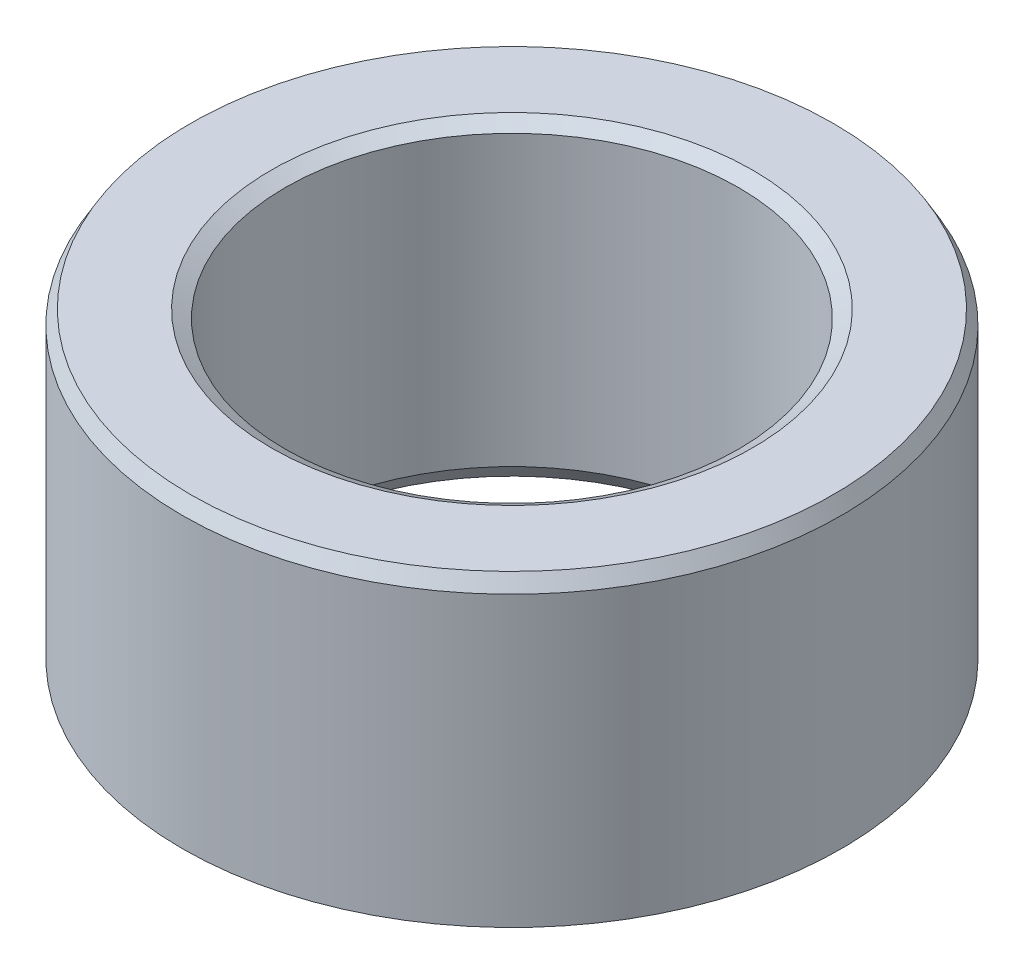
ISO-10303-21;
HEADER;
FILE_DESCRIPTION(('STEP AP214'),'2;1');
FILE_NAME('part.step','',(''),(''),'','','');
FILE_SCHEMA(('AUTOMOTIVE_DESIGN { 1 0 10303 214 1 1 1 1 }'));
ENDSEC;
DATA;
#1=APPLICATION_CONTEXT('core data for automotive mechanical design processes');
#2=APPLICATION_PROTOCOL_DEFINITION('international standard','automotive_design',2000,#1);
#3=PRODUCT_CONTEXT('',#1,'mechanical');
#4=PRODUCT('Part','Part','',(#3));
#5=PRODUCT_RELATED_PRODUCT_CATEGORY('part','',(#4));
#6=PRODUCT_DEFINITION_FORMATION('','',#4);
#7=PRODUCT_DEFINITION_CONTEXT('part definition',#1,'design');
#8=PRODUCT_DEFINITION('design','',#6,#7);
#9=PRODUCT_DEFINITION_SHAPE('','',#8);
#10=(LENGTH_UNIT() NAMED_UNIT(*) SI_UNIT(.MILLI.,.METRE.));
#11=(NAMED_UNIT(*) PLANE_ANGLE_UNIT() SI_UNIT($,.RADIAN.));
#12=(NAMED_UNIT(*) SI_UNIT($,.STERADIAN.) SOLID_ANGLE_UNIT());
#13=UNCERTAINTY_MEASURE_WITH_UNIT(LENGTH_MEASURE(1.E-05),#10,'distance_accuracy_value','');
#14=(GEOMETRIC_REPRESENTATION_CONTEXT(3) GLOBAL_UNCERTAINTY_ASSIGNED_CONTEXT((#13)) GLOBAL_UNIT_ASSIGNED_CONTEXT((#10,
#11,#12)) REPRESENTATION_CONTEXT('',''));
#15=CARTESIAN_POINT('',(0.,0.,0.));
#16=DIRECTION('',(0.,0.,1.));
#17=DIRECTION('',(1.,0.,0.));
#18=AXIS2_PLACEMENT_3D('',#15,#16,#17);
#19=CARTESIAN_POINT('',(0.,33.0032769411788,0.));
#20=DIRECTION('',(0.,-1.,0.));
#21=DIRECTION('',(0.,0.,-1.));
#22=AXIS2_PLACEMENT_3D('',#19,#20,#21);
#23=CYLINDRICAL_SURFACE('',#22,35.);
#24=CARTESIAN_POINT('',(0.,0.861359611604738,0.));
#25=DIRECTION('',(0.,1.,0.));
#26=DIRECTION('',(0.,0.,1.));
#27=AXIS2_PLACEMENT_3D('',#24,#25,#26);
#28=CIRCLE('',#27,35.);
#29=CARTESIAN_POINT('',(0.,0.861359611604738,35.));
#30=VERTEX_POINT('',#29);
#31=EDGE_CURVE('E10',#30,#30,#28,.T.);
#32=ORIENTED_EDGE('',*,*,#31,.T.);
#33=EDGE_LOOP('',(#32));
#34=FACE_BOUND('',#33,.T.);
#35=CARTESIAN_POINT('',(0.,31.5113583302916,0.));
#36=DIRECTION('',(0.,1.,0.));
#37=DIRECTION('',(0.,0.,1.));
#38=AXIS2_PLACEMENT_3D('',#35,#36,#37);
#39=CIRCLE('',#38,35.);
#40=CARTESIAN_POINT('',(0.,31.5113583302916,35.));
#41=VERTEX_POINT('',#40);
#42=EDGE_CURVE('E50',#41,#41,#39,.F.);
#43=ORIENTED_EDGE('',*,*,#42,.T.);
#44=EDGE_LOOP('',(#43));
#45=FACE_BOUND('',#44,.T.);
#46=ADVANCED_FACE('F39',(#34,#45),#23,.T.);
#47=CARTESIAN_POINT('',(0.,33.0032769411788,0.));
#48=DIRECTION('',(0.,1.,0.));
#49=DIRECTION('',(0.,0.,1.));
#50=AXIS2_PLACEMENT_3D('',#47,#48,#49);
#51=PLANE('',#50);
#52=CARTESIAN_POINT('',(0.,33.0032769411788,0.));
#53=DIRECTION('',(0.,1.,0.));
#54=DIRECTION('',(0.,0.,1.));
#55=AXIS2_PLACEMENT_3D('',#52,#53,#54);
#56=CIRCLE('',#55,25.5603999597916);
#57=CARTESIAN_POINT('',(0.,33.0032769411788,25.5603999597916));
#58=VERTEX_POINT('',#57);
#59=EDGE_CURVE('E58',#58,#58,#56,.F.);
#60=ORIENTED_EDGE('',*,*,#59,.T.);
#61=EDGE_LOOP('',(#60));
#62=FACE_BOUND('',#61,.T.);
#63=CARTESIAN_POINT('',(0.,33.0032769411788,0.));
#64=DIRECTION('',(0.,1.,0.));
#65=DIRECTION('',(0.,0.,1.));
#66=AXIS2_PLACEMENT_3D('',#63,#64,#65);
#67=CIRCLE('',#66,34.1386403883952);
#68=CARTESIAN_POINT('',(0.,33.0032769411788,34.1386403883952));
#69=VERTEX_POINT('',#68);
#70=EDGE_CURVE('E61',#69,#69,#67,.T.);
#71=ORIENTED_EDGE('',*,*,#70,.T.);
#72=EDGE_LOOP('',(#71));
#73=FACE_BOUND('',#72,.T.);
#74=ADVANCED_FACE('F88',(#62,#73),#51,.T.);
#75=CARTESIAN_POINT('',(0.,0.,0.));
#76=DIRECTION('',(0.,1.,0.));
#77=DIRECTION('',(0.,0.,1.));
#78=AXIS2_PLACEMENT_3D('',#75,#76,#77);
#79=PLANE('',#78);
#80=CARTESIAN_POINT('',(0.,0.,0.));
#81=DIRECTION('',(0.,1.,0.));
#82=DIRECTION('',(0.,0.,1.));
#83=AXIS2_PLACEMENT_3D('',#80,#81,#82);
#84=CIRCLE('',#83,24.9298409605091);
#85=CARTESIAN_POINT('',(0.,0.,24.9298409605091));
#86=VERTEX_POINT('',#85);
#87=EDGE_CURVE('E51',#86,#86,#84,.T.);
#88=ORIENTED_EDGE('',*,*,#87,.T.);
#89=EDGE_LOOP('',(#88));
#90=FACE_BOUND('',#89,.T.);
#91=CARTESIAN_POINT('',(0.,0.,0.));
#92=DIRECTION('',(0.,1.,0.));
#93=DIRECTION('',(0.,0.,1.));
#94=AXIS2_PLACEMENT_3D('',#91,#92,#93);
#95=CIRCLE('',#94,33.5080813891128);
#96=CARTESIAN_POINT('',(0.,0.,33.5080813891128));
#97=VERTEX_POINT('',#96);
#98=EDGE_CURVE('E54',#97,#97,#95,.F.);
#99=ORIENTED_EDGE('',*,*,#98,.T.);
#100=EDGE_LOOP('',(#99));
#101=FACE_BOUND('',#100,.T.);
#102=ADVANCED_FACE('F83',(#90,#101),#79,.F.);
#103=CARTESIAN_POINT('',(0.,33.0032769411788,0.));
#104=DIRECTION('',(0.,-1.,0.));
#105=DIRECTION('',(0.,0.,-1.));
#106=AXIS2_PLACEMENT_3D('',#103,#104,#105);
#107=CYLINDRICAL_SURFACE('',#106,24.0684813489044);
#108=CARTESIAN_POINT('',(0.,32.1419173295741,0.));
#109=DIRECTION('',(0.,1.,0.));
#110=DIRECTION('',(0.,0.,1.));
#111=AXIS2_PLACEMENT_3D('',#108,#109,#110);
#112=CIRCLE('',#111,24.0684813489044);
#113=CARTESIAN_POINT('',(0.,32.1419173295741,24.0684813489044));
#114=VERTEX_POINT('',#113);
#115=EDGE_CURVE('E67',#114,#114,#112,.T.);
#116=ORIENTED_EDGE('',*,*,#115,.T.);
#117=EDGE_LOOP('',(#116));
#118=FACE_BOUND('',#117,.T.);
#119=CARTESIAN_POINT('',(0.,1.49191861088722,0.));
#120=DIRECTION('',(0.,1.,0.));
#121=DIRECTION('',(0.,0.,1.));
#122=AXIS2_PLACEMENT_3D('',#119,#120,#121);
#123=CIRCLE('',#122,24.0684813489044);
#124=CARTESIAN_POINT('',(0.,1.49191861088722,24.0684813489044));
#125=VERTEX_POINT('',#124);
#126=EDGE_CURVE('E69',#125,#125,#123,.F.);
#127=ORIENTED_EDGE('',*,*,#126,.T.);
#128=EDGE_LOOP('',(#127));
#129=FACE_BOUND('',#128,.T.);
#130=ADVANCED_FACE('F71',(#118,#129),#107,.F.);
#131=CARTESIAN_POINT('',(0.,32.1419173295741,0.));
#132=DIRECTION('',(0.,1.,0.));
#133=DIRECTION('',(0.,0.,1.));
#134=AXIS2_PLACEMENT_3D('',#131,#132,#133);
#135=CONICAL_SURFACE('',#134,24.0684813489044,1.0471975511966);
#136=CARTESIAN_POINT('',(0.,33.0032769411788,25.5603999597916));
#137=CARTESIAN_POINT('',(0.,32.9943044452246,25.5448591409282));
#138=CARTESIAN_POINT('',(0.,32.9853319492704,25.5293183220648));
#139=CARTESIAN_POINT('',(0.,32.9673869573619,25.498236684338));
#140=CARTESIAN_POINT('',(0.,32.9584144614077,25.4826958654746));
#141=CARTESIAN_POINT('',(0.,32.9404694694993,25.4516142277478));
#142=CARTESIAN_POINT('',(0.,32.9314969735451,25.4360734088844));
#143=CARTESIAN_POINT('',(0.,32.9135519816367,25.4049917711576));
#144=CARTESIAN_POINT('',(0.,32.9045794856824,25.3894509522941));
#145=CARTESIAN_POINT('',(0.,32.886634493774,25.3583693145673));
#146=CARTESIAN_POINT('',(0.,32.8776619978198,25.3428284957039));
#147=CARTESIAN_POINT('',(0.,32.8597170059114,25.3117468579771));
#148=CARTESIAN_POINT('',(0.,32.8507445099571,25.2962060391137));
#149=CARTESIAN_POINT('',(0.,32.8327995180487,25.2651244013869));
#150=CARTESIAN_POINT('',(0.,32.8238270220945,25.2495835825235));
#151=CARTESIAN_POINT('',(0.,32.8058820301861,25.2185019447966));
#152=CARTESIAN_POINT('',(0.,32.7969095342318,25.2029611259332));
#153=CARTESIAN_POINT('',(0.,32.7789645423234,25.1718794882064));
#154=CARTESIAN_POINT('',(0.,32.7699920463692,25.156338669343));
#155=CARTESIAN_POINT('',(0.,32.7520470544608,25.1252570316162));
#156=CARTESIAN_POINT('',(0.,32.7430745585065,25.1097162127528));
#157=CARTESIAN_POINT('',(0.,32.7251295665981,25.078634575026));
#158=CARTESIAN_POINT('',(0.,32.7161570706439,25.0630937561626));
#159=CARTESIAN_POINT('',(0.,32.6982120787355,25.0320121184357));
#160=CARTESIAN_POINT('',(0.,32.6892395827813,25.0164712995723));
#161=CARTESIAN_POINT('',(0.,32.6712945908728,24.9853896618455));
#162=CARTESIAN_POINT('',(0.,32.6623220949186,24.9698488429821));
#163=CARTESIAN_POINT('',(0.,32.6443771030102,24.9387672052553));
#164=CARTESIAN_POINT('',(0.,32.635404607056,24.9232263863919));
#165=CARTESIAN_POINT('',(0.,32.6174596151475,24.8921447486651));
#166=CARTESIAN_POINT('',(0.,32.6084871191933,24.8766039298017));
#167=CARTESIAN_POINT('',(0.,32.5905421272849,24.8455222920748));
#168=CARTESIAN_POINT('',(0.,32.5815696313307,24.8299814732114));
#169=CARTESIAN_POINT('',(0.,32.5636246394222,24.7988998354846));
#170=CARTESIAN_POINT('',(0.,32.554652143468,24.7833590166212));
#171=CARTESIAN_POINT('',(0.,32.5367071515596,24.7522773788944));
#172=CARTESIAN_POINT('',(0.,32.5277346556054,24.736736560031));
#173=CARTESIAN_POINT('',(0.,32.5097896636969,24.7056549223042));
#174=CARTESIAN_POINT('',(0.,32.5008171677427,24.6901141034407));
#175=CARTESIAN_POINT('',(0.,32.4828721758343,24.6590324657139));
#176=CARTESIAN_POINT('',(0.,32.4738996798801,24.6434916468505));
#177=CARTESIAN_POINT('',(0.,32.4559546879716,24.6124100091237));
#178=CARTESIAN_POINT('',(0.,32.4469821920174,24.5968691902603));
#179=CARTESIAN_POINT('',(0.,32.429037200109,24.5657875525335));
#180=CARTESIAN_POINT('',(0.,32.4200647041548,24.5502467336701));
#181=CARTESIAN_POINT('',(0.,32.4021197122463,24.5191650959433));
#182=CARTESIAN_POINT('',(0.,32.3931472162921,24.5036242770798));
#183=CARTESIAN_POINT('',(0.,32.3752022243837,24.472542639353));
#184=CARTESIAN_POINT('',(0.,32.3662297284295,24.4570018204896));
#185=CARTESIAN_POINT('',(0.,32.348284736521,24.4259201827628));
#186=CARTESIAN_POINT('',(0.,32.3393122405668,24.4103793638994));
#187=CARTESIAN_POINT('',(0.,32.3213672486584,24.3792977261726));
#188=CARTESIAN_POINT('',(0.,32.3123947527042,24.3637569073092));
#189=CARTESIAN_POINT('',(0.,32.2944497607957,24.3326752695823));
#190=CARTESIAN_POINT('',(0.,32.2854772648415,24.3171344507189));
#191=CARTESIAN_POINT('',(0.,32.2675322729331,24.2860528129921));
#192=CARTESIAN_POINT('',(0.,32.2585597769789,24.2705119941287));
#193=CARTESIAN_POINT('',(0.,32.2406147850704,24.2394303564019));
#194=CARTESIAN_POINT('',(0.,32.2316422891162,24.2238895375385));
#195=CARTESIAN_POINT('',(0.,32.2136972972078,24.1928078998117));
#196=CARTESIAN_POINT('',(0.,32.2047248012536,24.1772670809483));
#197=CARTESIAN_POINT('',(0.,32.1867798093451,24.1461854432214));
#198=CARTESIAN_POINT('',(0.,32.1778073133909,24.130644624358));
#199=CARTESIAN_POINT('',(0.,32.1598623214825,24.0995629866312));
#200=CARTESIAN_POINT('',(0.,32.1508898255283,24.0840221677678));
#201=CARTESIAN_POINT('',(0.,32.1419173295741,24.0684813489044));
#202=B_SPLINE_CURVE_WITH_KNOTS('',3,(#136,#137,#138,#139,#140,#141,#142,#143,#144,#145,#146,
#147,#148,#149,#150,#151,#152,#153,#154,#155,#156,#157,#158,#159,#160,#161,#162,#163,#164,#165,
#166,#167,#168,#169,#170,#171,#172,#173,#174,#175,#176,#177,#178,#179,#180,#181,#182,#183,#184,
#185,#186,#187,#188,#189,#190,#191,#192,#193,#194,#195,#196,#197,#198,#199,#200,#201),
.UNSPECIFIED.,.F.,.F.,(4,2,2,2,2,2,2,2,2,2,2,2,2,2,2,2,2,2,2,2,2,2,2,2,2,2,2,2,2,2,2,2,4),(0.,
0.053834975725298,0.107669951450596,0.161504927175893,0.215339902901191,0.269174878626485,
0.323009854351783,0.376844830077084,0.430679805802381,0.484514781527679,0.538349757252974,
0.592184732978271,0.646019708703569,0.69985468442887,0.753689660154167,0.807524635879462,
0.861359611604759,0.915194587330057,0.969029563055354,1.02286453878065,1.07669951450595,
1.13053449023125,1.18436946595655,1.23820444168184,1.29203941740714,1.34587439313244,
1.39970936885774,1.45354434458303,1.50737932030833,1.56121429603363,1.61504927175892,
1.66888424748422,1.72271922320952),.UNSPECIFIED.);
#203=EDGE_CURVE('BSEAM77',#58,#114,#202,.T.);
#204=ORIENTED_EDGE('',*,*,#59,.F.);
#205=ORIENTED_EDGE('',*,*,#115,.F.);
#206=ORIENTED_EDGE('',*,*,#203,.T.);
#207=ORIENTED_EDGE('',*,*,#203,.F.);
#208=EDGE_LOOP('',(#204,#206,#205,#207));
#209=FACE_BOUND('',#208,.T.);
#210=ADVANCED_FACE('F77',(#209),#135,.F.);
#211=CARTESIAN_POINT('',(0.,0.,0.));
#212=DIRECTION('',(0.,-1.,0.));
#213=DIRECTION('',(0.,0.,-1.));
#214=AXIS2_PLACEMENT_3D('',#211,#212,#213);
#215=CONICAL_SURFACE('',#214,24.9298409605091,0.523598775598294);
#216=ORIENTED_EDGE('',*,*,#126,.F.);
#217=EDGE_LOOP('',(#216));
#218=FACE_BOUND('',#217,.T.);
#219=ORIENTED_EDGE('',*,*,#87,.F.);
#220=EDGE_LOOP('',(#219));
#221=FACE_BOUND('',#220,.T.);
#222=ADVANCED_FACE('F73',(#218,#221),#215,.F.);
#223=CARTESIAN_POINT('',(0.,0.861359611604738,0.));
#224=DIRECTION('',(0.,1.,0.));
#225=DIRECTION('',(0.,0.,1.));
#226=AXIS2_PLACEMENT_3D('',#223,#224,#225);
#227=CONICAL_SURFACE('',#226,35.,1.0471975511966);
#228=ORIENTED_EDGE('',*,*,#98,.F.);
#229=EDGE_LOOP('',(#228));
#230=FACE_BOUND('',#229,.T.);
#231=ORIENTED_EDGE('',*,*,#31,.F.);
#232=EDGE_LOOP('',(#231));
#233=FACE_BOUND('',#232,.T.);
#234=ADVANCED_FACE('F76',(#230,#233),#227,.T.);
#235=CARTESIAN_POINT('',(0.,33.0032769411788,0.));
#236=DIRECTION('',(0.,-1.,0.));
#237=DIRECTION('',(0.,0.,-1.));
#238=AXIS2_PLACEMENT_3D('',#235,#236,#237);
#239=CONICAL_SURFACE('',#238,34.1386403883952,0.523598775598301);
#240=ORIENTED_EDGE('',*,*,#42,.F.);
#241=EDGE_LOOP('',(#240));
#242=FACE_BOUND('',#241,.T.);
#243=ORIENTED_EDGE('',*,*,#70,.F.);
#244=EDGE_LOOP('',(#243));
#245=FACE_BOUND('',#244,.T.);
#246=ADVANCED_FACE('F45',(#242,#245),#239,.T.);
#247=CLOSED_SHELL('',(#46,#74,#102,#130,#210,#222,#234,#246));
#248=MANIFOLD_SOLID_BREP('B2',#247);
#249=ADVANCED_BREP_SHAPE_REPRESENTATION('',(#18,#248),#14);
#250=SHAPE_DEFINITION_REPRESENTATION(#9,#249);
ENDSEC;
END-ISO-10303-21;
